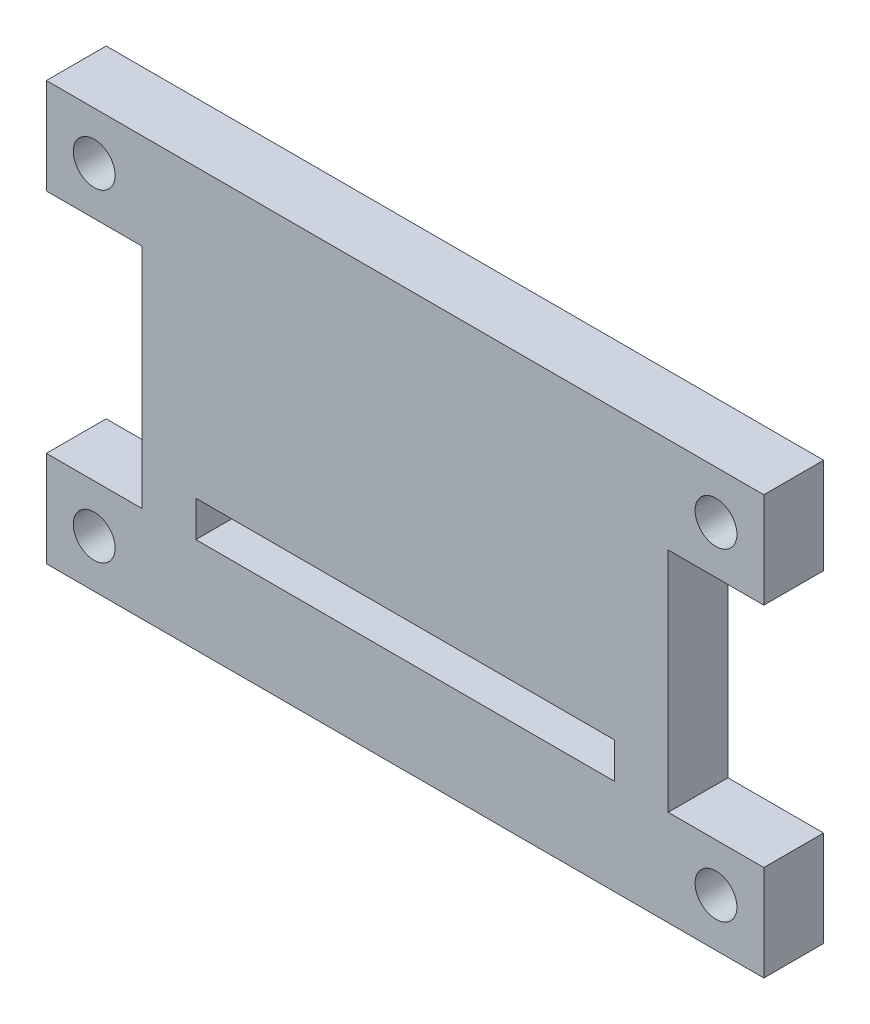
ISO-10303-21;
HEADER;
FILE_DESCRIPTION(('STEP AP214'),'2;1');
FILE_NAME('part.step','',(''),(''),'','','');
FILE_SCHEMA(('AUTOMOTIVE_DESIGN { 1 0 10303 214 1 1 1 1 }'));
ENDSEC;
DATA;
#1=APPLICATION_CONTEXT('core data for automotive mechanical design processes');
#2=APPLICATION_PROTOCOL_DEFINITION('international standard','automotive_design',2000,#1);
#3=PRODUCT_CONTEXT('',#1,'mechanical');
#4=PRODUCT('Part','Part','',(#3));
#5=PRODUCT_RELATED_PRODUCT_CATEGORY('part','',(#4));
#6=PRODUCT_DEFINITION_FORMATION('','',#4);
#7=PRODUCT_DEFINITION_CONTEXT('part definition',#1,'design');
#8=PRODUCT_DEFINITION('design','',#6,#7);
#9=PRODUCT_DEFINITION_SHAPE('','',#8);
#10=(LENGTH_UNIT() NAMED_UNIT(*) SI_UNIT(.MILLI.,.METRE.));
#11=(NAMED_UNIT(*) PLANE_ANGLE_UNIT() SI_UNIT($,.RADIAN.));
#12=(NAMED_UNIT(*) SI_UNIT($,.STERADIAN.) SOLID_ANGLE_UNIT());
#13=UNCERTAINTY_MEASURE_WITH_UNIT(LENGTH_MEASURE(1.E-05),#10,'distance_accuracy_value','');
#14=(GEOMETRIC_REPRESENTATION_CONTEXT(3) GLOBAL_UNCERTAINTY_ASSIGNED_CONTEXT((#13)) GLOBAL_UNIT_ASSIGNED_CONTEXT((#10,
#11,#12)) REPRESENTATION_CONTEXT('',''));
#15=CARTESIAN_POINT('',(0.,0.,0.));
#16=DIRECTION('',(0.,0.,1.));
#17=DIRECTION('',(1.,0.,0.));
#18=AXIS2_PLACEMENT_3D('',#15,#16,#17);
#19=CARTESIAN_POINT('',(0.,17.5,5.));
#20=DIRECTION('',(0.,1.,0.));
#21=DIRECTION('',(0.,0.,1.));
#22=AXIS2_PLACEMENT_3D('',#19,#20,#21);
#23=PLANE('',#22);
#24=DIRECTION('',(1.,0.,0.));
#25=VECTOR('',#24,1.);
#26=CARTESIAN_POINT('',(0.,17.5,0.));
#27=LINE('',#26,#25);
#28=CARTESIAN_POINT('',(-30.,17.5,0.));
#29=VERTEX_POINT('',#28);
#30=CARTESIAN_POINT('',(30.,17.5,0.));
#31=VERTEX_POINT('',#30);
#32=EDGE_CURVE('E232',#29,#31,#27,.T.);
#33=ORIENTED_EDGE('',*,*,#32,.F.);
#34=DIRECTION('',(0.,0.,-1.));
#35=VECTOR('',#34,1.);
#36=CARTESIAN_POINT('',(-30.,17.5,5.));
#37=LINE('',#36,#35);
#38=CARTESIAN_POINT('',(-30.,17.5,5.));
#39=VERTEX_POINT('',#38);
#40=EDGE_CURVE('E11',#39,#29,#37,.T.);
#41=ORIENTED_EDGE('',*,*,#40,.F.);
#42=DIRECTION('',(1.,0.,0.));
#43=VECTOR('',#42,1.);
#44=CARTESIAN_POINT('',(0.,17.5,5.));
#45=LINE('',#44,#43);
#46=CARTESIAN_POINT('',(30.,17.5,5.));
#47=VERTEX_POINT('',#46);
#48=EDGE_CURVE('E187',#39,#47,#45,.T.);
#49=ORIENTED_EDGE('',*,*,#48,.T.);
#50=DIRECTION('',(0.,0.,-1.));
#51=VECTOR('',#50,1.);
#52=CARTESIAN_POINT('',(30.,17.5,5.));
#53=LINE('',#52,#51);
#54=EDGE_CURVE('E229',#47,#31,#53,.T.);
#55=ORIENTED_EDGE('',*,*,#54,.T.);
#56=EDGE_LOOP('',(#33,#41,#49,#55));
#57=FACE_BOUND('',#56,.T.);
#58=ADVANCED_FACE('F35',(#57),#23,.T.);
#59=CARTESIAN_POINT('',(-30.,0.,5.));
#60=DIRECTION('',(-1.,0.,0.));
#61=DIRECTION('',(0.,-1.,0.));
#62=AXIS2_PLACEMENT_3D('',#59,#60,#61);
#63=PLANE('',#62);
#64=DIRECTION('',(0.,1.,0.));
#65=VECTOR('',#64,1.);
#66=CARTESIAN_POINT('',(-30.,0.,0.));
#67=LINE('',#66,#65);
#68=CARTESIAN_POINT('',(-30.,9.5,0.));
#69=VERTEX_POINT('',#68);
#70=EDGE_CURVE('E235',#69,#29,#67,.T.);
#71=ORIENTED_EDGE('',*,*,#70,.F.);
#72=DIRECTION('',(0.,0.,-1.));
#73=VECTOR('',#72,1.);
#74=CARTESIAN_POINT('',(-30.,9.5,5.));
#75=LINE('',#74,#73);
#76=CARTESIAN_POINT('',(-30.,9.5,5.));
#77=VERTEX_POINT('',#76);
#78=EDGE_CURVE('E43',#77,#69,#75,.T.);
#79=ORIENTED_EDGE('',*,*,#78,.F.);
#80=DIRECTION('',(0.,1.,0.));
#81=VECTOR('',#80,1.);
#82=CARTESIAN_POINT('',(-30.,0.,5.));
#83=LINE('',#82,#81);
#84=EDGE_CURVE('E191',#77,#39,#83,.T.);
#85=ORIENTED_EDGE('',*,*,#84,.T.);
#86=ORIENTED_EDGE('',*,*,#40,.T.);
#87=EDGE_LOOP('',(#71,#79,#85,#86));
#88=FACE_BOUND('',#87,.T.);
#89=ADVANCED_FACE('F306',(#88),#63,.T.);
#90=CARTESIAN_POINT('',(0.,9.5,5.));
#91=DIRECTION('',(0.,1.,0.));
#92=DIRECTION('',(0.,0.,1.));
#93=AXIS2_PLACEMENT_3D('',#90,#91,#92);
#94=PLANE('',#93);
#95=DIRECTION('',(1.,0.,0.));
#96=VECTOR('',#95,1.);
#97=CARTESIAN_POINT('',(0.,9.5,0.));
#98=LINE('',#97,#96);
#99=CARTESIAN_POINT('',(-22.,9.5,0.));
#100=VERTEX_POINT('',#99);
#101=EDGE_CURVE('E238',#69,#100,#98,.T.);
#102=ORIENTED_EDGE('',*,*,#101,.T.);
#103=DIRECTION('',(0.,0.,-1.));
#104=VECTOR('',#103,1.);
#105=CARTESIAN_POINT('',(-22.,9.5,5.));
#106=LINE('',#105,#104);
#107=CARTESIAN_POINT('',(-22.,9.5,5.));
#108=VERTEX_POINT('',#107);
#109=EDGE_CURVE('E294',#108,#100,#106,.T.);
#110=ORIENTED_EDGE('',*,*,#109,.F.);
#111=DIRECTION('',(1.,0.,0.));
#112=VECTOR('',#111,1.);
#113=CARTESIAN_POINT('',(0.,9.5,5.));
#114=LINE('',#113,#112);
#115=EDGE_CURVE('E194',#77,#108,#114,.T.);
#116=ORIENTED_EDGE('',*,*,#115,.F.);
#117=ORIENTED_EDGE('',*,*,#78,.T.);
#118=EDGE_LOOP('',(#102,#110,#116,#117));
#119=FACE_BOUND('',#118,.T.);
#120=ADVANCED_FACE('F299',(#119),#94,.F.);
#121=CARTESIAN_POINT('',(-22.,0.,5.));
#122=DIRECTION('',(1.,0.,0.));
#123=DIRECTION('',(0.,0.,-1.));
#124=AXIS2_PLACEMENT_3D('',#121,#122,#123);
#125=PLANE('',#124);
#126=DIRECTION('',(0.,-1.,0.));
#127=VECTOR('',#126,1.);
#128=CARTESIAN_POINT('',(-22.,0.,0.));
#129=LINE('',#128,#127);
#130=CARTESIAN_POINT('',(-22.,-9.49999999999999,0.));
#131=VERTEX_POINT('',#130);
#132=EDGE_CURVE('E241',#100,#131,#129,.T.);
#133=ORIENTED_EDGE('',*,*,#132,.T.);
#134=DIRECTION('',(0.,0.,-1.));
#135=VECTOR('',#134,1.);
#136=CARTESIAN_POINT('',(-22.,-9.49999999999999,5.));
#137=LINE('',#136,#135);
#138=CARTESIAN_POINT('',(-22.,-9.49999999999999,5.));
#139=VERTEX_POINT('',#138);
#140=EDGE_CURVE('E292',#139,#131,#137,.T.);
#141=ORIENTED_EDGE('',*,*,#140,.F.);
#142=DIRECTION('',(0.,-1.,0.));
#143=VECTOR('',#142,1.);
#144=CARTESIAN_POINT('',(-22.,0.,5.));
#145=LINE('',#144,#143);
#146=EDGE_CURVE('E197',#108,#139,#145,.T.);
#147=ORIENTED_EDGE('',*,*,#146,.F.);
#148=ORIENTED_EDGE('',*,*,#109,.T.);
#149=EDGE_LOOP('',(#133,#141,#147,#148));
#150=FACE_BOUND('',#149,.T.);
#151=ADVANCED_FACE('F343',(#150),#125,.F.);
#152=CARTESIAN_POINT('',(0.,-9.49999999999999,5.));
#153=DIRECTION('',(0.,1.,0.));
#154=DIRECTION('',(0.,0.,1.));
#155=AXIS2_PLACEMENT_3D('',#152,#153,#154);
#156=PLANE('',#155);
#157=DIRECTION('',(1.,0.,0.));
#158=VECTOR('',#157,1.);
#159=CARTESIAN_POINT('',(0.,-9.49999999999999,0.));
#160=LINE('',#159,#158);
#161=CARTESIAN_POINT('',(-30.,-9.49999999999999,0.));
#162=VERTEX_POINT('',#161);
#163=EDGE_CURVE('E244',#162,#131,#160,.T.);
#164=ORIENTED_EDGE('',*,*,#163,.F.);
#165=DIRECTION('',(0.,0.,-1.));
#166=VECTOR('',#165,1.);
#167=CARTESIAN_POINT('',(-30.,-9.49999999999999,5.));
#168=LINE('',#167,#166);
#169=CARTESIAN_POINT('',(-30.,-9.49999999999999,5.));
#170=VERTEX_POINT('',#169);
#171=EDGE_CURVE('E290',#170,#162,#168,.T.);
#172=ORIENTED_EDGE('',*,*,#171,.F.);
#173=DIRECTION('',(1.,0.,0.));
#174=VECTOR('',#173,1.);
#175=CARTESIAN_POINT('',(0.,-9.49999999999999,5.));
#176=LINE('',#175,#174);
#177=EDGE_CURVE('E199',#170,#139,#176,.T.);
#178=ORIENTED_EDGE('',*,*,#177,.T.);
#179=ORIENTED_EDGE('',*,*,#140,.T.);
#180=EDGE_LOOP('',(#164,#172,#178,#179));
#181=FACE_BOUND('',#180,.T.);
#182=ADVANCED_FACE('F338',(#181),#156,.T.);
#183=CARTESIAN_POINT('',(-30.,0.,5.));
#184=DIRECTION('',(1.,0.,0.));
#185=DIRECTION('',(0.,1.,0.));
#186=AXIS2_PLACEMENT_3D('',#183,#184,#185);
#187=PLANE('',#186);
#188=DIRECTION('',(0.,-1.,0.));
#189=VECTOR('',#188,1.);
#190=CARTESIAN_POINT('',(-30.,0.,0.));
#191=LINE('',#190,#189);
#192=CARTESIAN_POINT('',(-30.,-17.5,0.));
#193=VERTEX_POINT('',#192);
#194=EDGE_CURVE('E247',#162,#193,#191,.T.);
#195=ORIENTED_EDGE('',*,*,#194,.T.);
#196=DIRECTION('',(0.,0.,-1.));
#197=VECTOR('',#196,1.);
#198=CARTESIAN_POINT('',(-30.,-17.5,5.));
#199=LINE('',#198,#197);
#200=CARTESIAN_POINT('',(-30.,-17.5,5.));
#201=VERTEX_POINT('',#200);
#202=EDGE_CURVE('E287',#201,#193,#199,.T.);
#203=ORIENTED_EDGE('',*,*,#202,.F.);
#204=DIRECTION('',(0.,-1.,0.));
#205=VECTOR('',#204,1.);
#206=CARTESIAN_POINT('',(-30.,0.,5.));
#207=LINE('',#206,#205);
#208=EDGE_CURVE('E202',#170,#201,#207,.T.);
#209=ORIENTED_EDGE('',*,*,#208,.F.);
#210=ORIENTED_EDGE('',*,*,#171,.T.);
#211=EDGE_LOOP('',(#195,#203,#209,#210));
#212=FACE_BOUND('',#211,.T.);
#213=ADVANCED_FACE('F373',(#212),#187,.F.);
#214=CARTESIAN_POINT('',(0.,-17.5,5.));
#215=DIRECTION('',(0.,1.,0.));
#216=DIRECTION('',(-1.,0.,0.));
#217=AXIS2_PLACEMENT_3D('',#214,#215,#216);
#218=PLANE('',#217);
#219=DIRECTION('',(1.,0.,0.));
#220=VECTOR('',#219,1.);
#221=CARTESIAN_POINT('',(0.,-17.5,0.));
#222=LINE('',#221,#220);
#223=CARTESIAN_POINT('',(30.,-17.5,0.));
#224=VERTEX_POINT('',#223);
#225=EDGE_CURVE('E250',#193,#224,#222,.T.);
#226=ORIENTED_EDGE('',*,*,#225,.T.);
#227=DIRECTION('',(0.,0.,-1.));
#228=VECTOR('',#227,1.);
#229=CARTESIAN_POINT('',(30.,-17.5,5.));
#230=LINE('',#229,#228);
#231=CARTESIAN_POINT('',(30.,-17.5,5.));
#232=VERTEX_POINT('',#231);
#233=EDGE_CURVE('E285',#232,#224,#230,.T.);
#234=ORIENTED_EDGE('',*,*,#233,.F.);
#235=DIRECTION('',(1.,0.,0.));
#236=VECTOR('',#235,1.);
#237=CARTESIAN_POINT('',(0.,-17.5,5.));
#238=LINE('',#237,#236);
#239=EDGE_CURVE('E205',#201,#232,#238,.T.);
#240=ORIENTED_EDGE('',*,*,#239,.F.);
#241=ORIENTED_EDGE('',*,*,#202,.T.);
#242=EDGE_LOOP('',(#226,#234,#240,#241));
#243=FACE_BOUND('',#242,.T.);
#244=ADVANCED_FACE('F332',(#243),#218,.F.);
#245=CARTESIAN_POINT('',(30.,0.,5.));
#246=DIRECTION('',(1.,0.,0.));
#247=DIRECTION('',(0.,0.,-1.));
#248=AXIS2_PLACEMENT_3D('',#245,#246,#247);
#249=PLANE('',#248);
#250=DIRECTION('',(0.,-1.,0.));
#251=VECTOR('',#250,1.);
#252=CARTESIAN_POINT('',(30.,0.,0.));
#253=LINE('',#252,#251);
#254=CARTESIAN_POINT('',(30.,-9.49999999999999,0.));
#255=VERTEX_POINT('',#254);
#256=EDGE_CURVE('E253',#255,#224,#253,.T.);
#257=ORIENTED_EDGE('',*,*,#256,.F.);
#258=DIRECTION('',(0.,0.,-1.));
#259=VECTOR('',#258,1.);
#260=CARTESIAN_POINT('',(30.,-9.49999999999999,5.));
#261=LINE('',#260,#259);
#262=CARTESIAN_POINT('',(30.,-9.49999999999999,5.));
#263=VERTEX_POINT('',#262);
#264=EDGE_CURVE('E283',#263,#255,#261,.T.);
#265=ORIENTED_EDGE('',*,*,#264,.F.);
#266=DIRECTION('',(0.,-1.,0.));
#267=VECTOR('',#266,1.);
#268=CARTESIAN_POINT('',(30.,0.,5.));
#269=LINE('',#268,#267);
#270=EDGE_CURVE('E207',#263,#232,#269,.T.);
#271=ORIENTED_EDGE('',*,*,#270,.T.);
#272=ORIENTED_EDGE('',*,*,#233,.T.);
#273=EDGE_LOOP('',(#257,#265,#271,#272));
#274=FACE_BOUND('',#273,.T.);
#275=ADVANCED_FACE('F327',(#274),#249,.T.);
#276=CARTESIAN_POINT('',(0.,-9.49999999999999,5.));
#277=DIRECTION('',(0.,-1.,0.));
#278=DIRECTION('',(0.,0.,-1.));
#279=AXIS2_PLACEMENT_3D('',#276,#277,#278);
#280=PLANE('',#279);
#281=DIRECTION('',(-1.,0.,0.));
#282=VECTOR('',#281,1.);
#283=CARTESIAN_POINT('',(0.,-9.49999999999999,0.));
#284=LINE('',#283,#282);
#285=CARTESIAN_POINT('',(22.,-9.49999999999999,0.));
#286=VERTEX_POINT('',#285);
#287=EDGE_CURVE('E256',#255,#286,#284,.T.);
#288=ORIENTED_EDGE('',*,*,#287,.T.);
#289=DIRECTION('',(0.,0.,-1.));
#290=VECTOR('',#289,1.);
#291=CARTESIAN_POINT('',(22.,-9.49999999999999,5.));
#292=LINE('',#291,#290);
#293=CARTESIAN_POINT('',(22.,-9.49999999999999,5.));
#294=VERTEX_POINT('',#293);
#295=EDGE_CURVE('E281',#294,#286,#292,.T.);
#296=ORIENTED_EDGE('',*,*,#295,.F.);
#297=DIRECTION('',(-1.,0.,0.));
#298=VECTOR('',#297,1.);
#299=CARTESIAN_POINT('',(0.,-9.49999999999999,5.));
#300=LINE('',#299,#298);
#301=EDGE_CURVE('E210',#263,#294,#300,.T.);
#302=ORIENTED_EDGE('',*,*,#301,.F.);
#303=ORIENTED_EDGE('',*,*,#264,.T.);
#304=EDGE_LOOP('',(#288,#296,#302,#303));
#305=FACE_BOUND('',#304,.T.);
#306=ADVANCED_FACE('F380',(#305),#280,.F.);
#307=CARTESIAN_POINT('',(22.,0.,5.));
#308=DIRECTION('',(1.,0.,0.));
#309=DIRECTION('',(0.,0.,-1.));
#310=AXIS2_PLACEMENT_3D('',#307,#308,#309);
#311=PLANE('',#310);
#312=DIRECTION('',(0.,-1.,0.));
#313=VECTOR('',#312,1.);
#314=CARTESIAN_POINT('',(22.,0.,0.));
#315=LINE('',#314,#313);
#316=CARTESIAN_POINT('',(22.,9.5,0.));
#317=VERTEX_POINT('',#316);
#318=EDGE_CURVE('E259',#317,#286,#315,.T.);
#319=ORIENTED_EDGE('',*,*,#318,.F.);
#320=DIRECTION('',(0.,0.,-1.));
#321=VECTOR('',#320,1.);
#322=CARTESIAN_POINT('',(22.,9.5,5.));
#323=LINE('',#322,#321);
#324=CARTESIAN_POINT('',(22.,9.5,5.));
#325=VERTEX_POINT('',#324);
#326=EDGE_CURVE('E279',#325,#317,#323,.T.);
#327=ORIENTED_EDGE('',*,*,#326,.F.);
#328=DIRECTION('',(0.,-1.,0.));
#329=VECTOR('',#328,1.);
#330=CARTESIAN_POINT('',(22.,0.,5.));
#331=LINE('',#330,#329);
#332=EDGE_CURVE('E212',#325,#294,#331,.T.);
#333=ORIENTED_EDGE('',*,*,#332,.T.);
#334=ORIENTED_EDGE('',*,*,#295,.T.);
#335=EDGE_LOOP('',(#319,#327,#333,#334));
#336=FACE_BOUND('',#335,.T.);
#337=ADVANCED_FACE('F321',(#336),#311,.T.);
#338=CARTESIAN_POINT('',(0.,9.49999999999999,5.));
#339=DIRECTION('',(0.,-1.,0.));
#340=DIRECTION('',(1.,0.,0.));
#341=AXIS2_PLACEMENT_3D('',#338,#339,#340);
#342=PLANE('',#341);
#343=DIRECTION('',(-1.,0.,0.));
#344=VECTOR('',#343,1.);
#345=CARTESIAN_POINT('',(0.,9.49999999999999,0.));
#346=LINE('',#345,#344);
#347=CARTESIAN_POINT('',(30.,9.50000000000001,0.));
#348=VERTEX_POINT('',#347);
#349=EDGE_CURVE('E262',#348,#317,#346,.T.);
#350=ORIENTED_EDGE('',*,*,#349,.F.);
#351=DIRECTION('',(0.,0.,-1.));
#352=VECTOR('',#351,1.);
#353=CARTESIAN_POINT('',(30.,9.50000000000001,5.));
#354=LINE('',#353,#352);
#355=CARTESIAN_POINT('',(30.,9.50000000000001,5.));
#356=VERTEX_POINT('',#355);
#357=EDGE_CURVE('E277',#356,#348,#354,.T.);
#358=ORIENTED_EDGE('',*,*,#357,.F.);
#359=DIRECTION('',(-1.,0.,0.));
#360=VECTOR('',#359,1.);
#361=CARTESIAN_POINT('',(0.,9.49999999999999,5.));
#362=LINE('',#361,#360);
#363=EDGE_CURVE('E215',#356,#325,#362,.T.);
#364=ORIENTED_EDGE('',*,*,#363,.T.);
#365=ORIENTED_EDGE('',*,*,#326,.T.);
#366=EDGE_LOOP('',(#350,#358,#364,#365));
#367=FACE_BOUND('',#366,.T.);
#368=ADVANCED_FACE('F315',(#367),#342,.T.);
#369=CARTESIAN_POINT('',(26.,-13.5,5.));
#370=DIRECTION('',(0.,0.,-1.));
#371=DIRECTION('',(-1.,0.,0.));
#372=AXIS2_PLACEMENT_3D('',#369,#370,#371);
#373=CYLINDRICAL_SURFACE('',#372,1.75);
#374=CARTESIAN_POINT('',(26.,-13.5,5.));
#375=DIRECTION('',(0.,0.,1.));
#376=DIRECTION('',(1.,0.,0.));
#377=AXIS2_PLACEMENT_3D('',#374,#375,#376);
#378=CIRCLE('',#377,1.75);
#379=CARTESIAN_POINT('',(27.75,-13.5,5.));
#380=VERTEX_POINT('',#379);
#381=EDGE_CURVE('E223',#380,#380,#378,.T.);
#382=ORIENTED_EDGE('',*,*,#381,.T.);
#383=EDGE_LOOP('',(#382));
#384=FACE_BOUND('',#383,.T.);
#385=CARTESIAN_POINT('',(26.,-13.5,0.));
#386=DIRECTION('',(0.,0.,1.));
#387=DIRECTION('',(1.,0.,0.));
#388=AXIS2_PLACEMENT_3D('',#385,#386,#387);
#389=CIRCLE('',#388,1.75);
#390=CARTESIAN_POINT('',(27.75,-13.5,0.));
#391=VERTEX_POINT('',#390);
#392=EDGE_CURVE('E271',#391,#391,#389,.T.);
#393=ORIENTED_EDGE('',*,*,#392,.F.);
#394=EDGE_LOOP('',(#393));
#395=FACE_BOUND('',#394,.T.);
#396=ADVANCED_FACE('F357',(#384,#395),#373,.F.);
#397=CARTESIAN_POINT('',(-26.,-13.5,5.));
#398=DIRECTION('',(0.,0.,-1.));
#399=DIRECTION('',(-1.,0.,0.));
#400=AXIS2_PLACEMENT_3D('',#397,#398,#399);
#401=CYLINDRICAL_SURFACE('',#400,1.75);
#402=CARTESIAN_POINT('',(-26.,-13.5,5.));
#403=DIRECTION('',(0.,0.,1.));
#404=DIRECTION('',(1.,0.,0.));
#405=AXIS2_PLACEMENT_3D('',#402,#403,#404);
#406=CIRCLE('',#405,1.75);
#407=CARTESIAN_POINT('',(-24.25,-13.5,5.));
#408=VERTEX_POINT('',#407);
#409=EDGE_CURVE('E220',#408,#408,#406,.T.);
#410=ORIENTED_EDGE('',*,*,#409,.T.);
#411=EDGE_LOOP('',(#410));
#412=FACE_BOUND('',#411,.T.);
#413=CARTESIAN_POINT('',(-26.,-13.5,0.));
#414=DIRECTION('',(0.,0.,1.));
#415=DIRECTION('',(1.,0.,0.));
#416=AXIS2_PLACEMENT_3D('',#413,#414,#415);
#417=CIRCLE('',#416,1.75);
#418=CARTESIAN_POINT('',(-24.25,-13.5,0.));
#419=VERTEX_POINT('',#418);
#420=EDGE_CURVE('E268',#419,#419,#417,.T.);
#421=ORIENTED_EDGE('',*,*,#420,.F.);
#422=EDGE_LOOP('',(#421));
#423=FACE_BOUND('',#422,.T.);
#424=ADVANCED_FACE('F349',(#412,#423),#401,.F.);
#425=CARTESIAN_POINT('',(30.,0.,5.));
#426=DIRECTION('',(-1.,0.,0.));
#427=DIRECTION('',(0.,0.,1.));
#428=AXIS2_PLACEMENT_3D('',#425,#426,#427);
#429=PLANE('',#428);
#430=DIRECTION('',(0.,1.,0.));
#431=VECTOR('',#430,1.);
#432=CARTESIAN_POINT('',(30.,0.,0.));
#433=LINE('',#432,#431);
#434=EDGE_CURVE('E265',#348,#31,#433,.T.);
#435=ORIENTED_EDGE('',*,*,#434,.T.);
#436=ORIENTED_EDGE('',*,*,#54,.F.);
#437=DIRECTION('',(0.,1.,0.));
#438=VECTOR('',#437,1.);
#439=CARTESIAN_POINT('',(30.,0.,5.));
#440=LINE('',#439,#438);
#441=EDGE_CURVE('E218',#356,#47,#440,.T.);
#442=ORIENTED_EDGE('',*,*,#441,.F.);
#443=ORIENTED_EDGE('',*,*,#357,.T.);
#444=EDGE_LOOP('',(#435,#436,#442,#443));
#445=FACE_BOUND('',#444,.T.);
#446=ADVANCED_FACE('F347',(#445),#429,.F.);
#447=CARTESIAN_POINT('',(-26.,13.5,5.));
#448=DIRECTION('',(0.,0.,-1.));
#449=DIRECTION('',(-1.,0.,0.));
#450=AXIS2_PLACEMENT_3D('',#447,#448,#449);
#451=CYLINDRICAL_SURFACE('',#450,1.75);
#452=CARTESIAN_POINT('',(-26.,13.5,5.));
#453=DIRECTION('',(0.,0.,1.));
#454=DIRECTION('',(1.,0.,0.));
#455=AXIS2_PLACEMENT_3D('',#452,#453,#454);
#456=CIRCLE('',#455,1.75);
#457=CARTESIAN_POINT('',(-24.25,13.5,5.));
#458=VERTEX_POINT('',#457);
#459=EDGE_CURVE('E184',#458,#458,#456,.T.);
#460=ORIENTED_EDGE('',*,*,#459,.T.);
#461=EDGE_LOOP('',(#460));
#462=FACE_BOUND('',#461,.T.);
#463=CARTESIAN_POINT('',(-26.,13.5,0.));
#464=DIRECTION('',(0.,0.,1.));
#465=DIRECTION('',(1.,0.,0.));
#466=AXIS2_PLACEMENT_3D('',#463,#464,#465);
#467=CIRCLE('',#466,1.75);
#468=CARTESIAN_POINT('',(-24.25,13.5,0.));
#469=VERTEX_POINT('',#468);
#470=EDGE_CURVE('E161',#469,#469,#467,.T.);
#471=ORIENTED_EDGE('',*,*,#470,.F.);
#472=EDGE_LOOP('',(#471));
#473=FACE_BOUND('',#472,.T.);
#474=ADVANCED_FACE('F37',(#462,#473),#451,.F.);
#475=CARTESIAN_POINT('',(26.,13.5,5.));
#476=DIRECTION('',(0.,0.,-1.));
#477=DIRECTION('',(-1.,0.,0.));
#478=AXIS2_PLACEMENT_3D('',#475,#476,#477);
#479=CYLINDRICAL_SURFACE('',#478,1.75);
#480=CARTESIAN_POINT('',(26.,13.5,5.));
#481=DIRECTION('',(0.,0.,1.));
#482=DIRECTION('',(1.,0.,0.));
#483=AXIS2_PLACEMENT_3D('',#480,#481,#482);
#484=CIRCLE('',#483,1.75);
#485=CARTESIAN_POINT('',(27.75,13.5,5.));
#486=VERTEX_POINT('',#485);
#487=EDGE_CURVE('E226',#486,#486,#484,.T.);
#488=ORIENTED_EDGE('',*,*,#487,.T.);
#489=EDGE_LOOP('',(#488));
#490=FACE_BOUND('',#489,.T.);
#491=CARTESIAN_POINT('',(26.,13.5,0.));
#492=DIRECTION('',(0.,0.,1.));
#493=DIRECTION('',(1.,0.,0.));
#494=AXIS2_PLACEMENT_3D('',#491,#492,#493);
#495=CIRCLE('',#494,1.75);
#496=CARTESIAN_POINT('',(27.75,13.5,0.));
#497=VERTEX_POINT('',#496);
#498=EDGE_CURVE('E188',#497,#497,#495,.T.);
#499=ORIENTED_EDGE('',*,*,#498,.F.);
#500=EDGE_LOOP('',(#499));
#501=FACE_BOUND('',#500,.T.);
#502=ADVANCED_FACE('F355',(#490,#501),#479,.F.);
#503=CARTESIAN_POINT('',(0.,0.,5.));
#504=DIRECTION('',(0.,0.,1.));
#505=DIRECTION('',(1.,0.,0.));
#506=AXIS2_PLACEMENT_3D('',#503,#504,#505);
#507=PLANE('',#506);
#508=DIRECTION('',(0.,1.,0.));
#509=VECTOR('',#508,1.);
#510=CARTESIAN_POINT('',(17.5,-6.49999999999999,5.));
#511=LINE('',#510,#509);
#512=CARTESIAN_POINT('',(17.5,-9.49999999999999,5.));
#513=VERTEX_POINT('',#512);
#514=CARTESIAN_POINT('',(17.5,-6.49999999999999,5.));
#515=VERTEX_POINT('',#514);
#516=EDGE_CURVE('E50',#513,#515,#511,.T.);
#517=ORIENTED_EDGE('',*,*,#516,.F.);
#518=DIRECTION('',(1.,0.,0.));
#519=VECTOR('',#518,1.);
#520=CARTESIAN_POINT('',(-17.5,-9.49999999999999,5.));
#521=LINE('',#520,#519);
#522=CARTESIAN_POINT('',(-17.5,-9.49999999999999,5.));
#523=VERTEX_POINT('',#522);
#524=EDGE_CURVE('E155',#523,#513,#521,.T.);
#525=ORIENTED_EDGE('',*,*,#524,.F.);
#526=DIRECTION('',(0.,-1.,0.));
#527=VECTOR('',#526,1.);
#528=CARTESIAN_POINT('',(-17.5,-6.49999999999999,5.));
#529=LINE('',#528,#527);
#530=CARTESIAN_POINT('',(-17.5,-6.49999999999999,5.));
#531=VERTEX_POINT('',#530);
#532=EDGE_CURVE('E175',#531,#523,#529,.T.);
#533=ORIENTED_EDGE('',*,*,#532,.F.);
#534=DIRECTION('',(-1.,0.,0.));
#535=VECTOR('',#534,1.);
#536=CARTESIAN_POINT('',(-17.5,-6.49999999999999,5.));
#537=LINE('',#536,#535);
#538=EDGE_CURVE('E169',#515,#531,#537,.T.);
#539=ORIENTED_EDGE('',*,*,#538,.F.);
#540=EDGE_LOOP('',(#517,#525,#533,#539));
#541=FACE_BOUND('',#540,.T.);
#542=ORIENTED_EDGE('',*,*,#459,.F.);
#543=EDGE_LOOP('',(#542));
#544=FACE_BOUND('',#543,.T.);
#545=ORIENTED_EDGE('',*,*,#48,.F.);
#546=ORIENTED_EDGE('',*,*,#84,.F.);
#547=ORIENTED_EDGE('',*,*,#115,.T.);
#548=ORIENTED_EDGE('',*,*,#146,.T.);
#549=ORIENTED_EDGE('',*,*,#177,.F.);
#550=ORIENTED_EDGE('',*,*,#208,.T.);
#551=ORIENTED_EDGE('',*,*,#239,.T.);
#552=ORIENTED_EDGE('',*,*,#270,.F.);
#553=ORIENTED_EDGE('',*,*,#301,.T.);
#554=ORIENTED_EDGE('',*,*,#332,.F.);
#555=ORIENTED_EDGE('',*,*,#363,.F.);
#556=ORIENTED_EDGE('',*,*,#441,.T.);
#557=EDGE_LOOP('',(#545,#546,#547,#548,#549,#550,#551,#552,#553,#554,#555,#556));
#558=FACE_BOUND('',#557,.T.);
#559=ORIENTED_EDGE('',*,*,#409,.F.);
#560=EDGE_LOOP('',(#559));
#561=FACE_BOUND('',#560,.T.);
#562=ORIENTED_EDGE('',*,*,#381,.F.);
#563=EDGE_LOOP('',(#562));
#564=FACE_BOUND('',#563,.T.);
#565=ORIENTED_EDGE('',*,*,#487,.F.);
#566=EDGE_LOOP('',(#565));
#567=FACE_BOUND('',#566,.T.);
#568=ADVANCED_FACE('F345',(#541,#544,#558,#561,#564,#567),#507,.T.);
#569=CARTESIAN_POINT('',(0.,0.,0.));
#570=DIRECTION('',(0.,0.,1.));
#571=DIRECTION('',(1.,0.,0.));
#572=AXIS2_PLACEMENT_3D('',#569,#570,#571);
#573=PLANE('',#572);
#574=DIRECTION('',(-1.,0.,0.));
#575=VECTOR('',#574,1.);
#576=CARTESIAN_POINT('',(-17.5,-9.49999999999999,0.));
#577=LINE('',#576,#575);
#578=CARTESIAN_POINT('',(17.5,-9.49999999999999,0.));
#579=VERTEX_POINT('',#578);
#580=CARTESIAN_POINT('',(-17.5,-9.49999999999999,0.));
#581=VERTEX_POINT('',#580);
#582=EDGE_CURVE('E167',#579,#581,#577,.T.);
#583=ORIENTED_EDGE('',*,*,#582,.F.);
#584=DIRECTION('',(0.,-1.,0.));
#585=VECTOR('',#584,1.);
#586=CARTESIAN_POINT('',(17.5,-6.49999999999999,0.));
#587=LINE('',#586,#585);
#588=CARTESIAN_POINT('',(17.5,-6.49999999999999,0.));
#589=VERTEX_POINT('',#588);
#590=EDGE_CURVE('E149',#589,#579,#587,.T.);
#591=ORIENTED_EDGE('',*,*,#590,.F.);
#592=DIRECTION('',(1.,0.,0.));
#593=VECTOR('',#592,1.);
#594=CARTESIAN_POINT('',(-17.5,-6.49999999999999,0.));
#595=LINE('',#594,#593);
#596=CARTESIAN_POINT('',(-17.5,-6.49999999999999,0.));
#597=VERTEX_POINT('',#596);
#598=EDGE_CURVE('E158',#597,#589,#595,.T.);
#599=ORIENTED_EDGE('',*,*,#598,.F.);
#600=DIRECTION('',(0.,1.,0.));
#601=VECTOR('',#600,1.);
#602=CARTESIAN_POINT('',(-17.5,-6.49999999999999,0.));
#603=LINE('',#602,#601);
#604=EDGE_CURVE('E58',#581,#597,#603,.T.);
#605=ORIENTED_EDGE('',*,*,#604,.F.);
#606=EDGE_LOOP('',(#583,#591,#599,#605));
#607=FACE_BOUND('',#606,.T.);
#608=ORIENTED_EDGE('',*,*,#470,.T.);
#609=EDGE_LOOP('',(#608));
#610=FACE_BOUND('',#609,.T.);
#611=ORIENTED_EDGE('',*,*,#32,.T.);
#612=ORIENTED_EDGE('',*,*,#434,.F.);
#613=ORIENTED_EDGE('',*,*,#349,.T.);
#614=ORIENTED_EDGE('',*,*,#318,.T.);
#615=ORIENTED_EDGE('',*,*,#287,.F.);
#616=ORIENTED_EDGE('',*,*,#256,.T.);
#617=ORIENTED_EDGE('',*,*,#225,.F.);
#618=ORIENTED_EDGE('',*,*,#194,.F.);
#619=ORIENTED_EDGE('',*,*,#163,.T.);
#620=ORIENTED_EDGE('',*,*,#132,.F.);
#621=ORIENTED_EDGE('',*,*,#101,.F.);
#622=ORIENTED_EDGE('',*,*,#70,.T.);
#623=EDGE_LOOP('',(#611,#612,#613,#614,#615,#616,#617,#618,#619,#620,#621,#622));
#624=FACE_BOUND('',#623,.T.);
#625=ORIENTED_EDGE('',*,*,#420,.T.);
#626=EDGE_LOOP('',(#625));
#627=FACE_BOUND('',#626,.T.);
#628=ORIENTED_EDGE('',*,*,#392,.T.);
#629=EDGE_LOOP('',(#628));
#630=FACE_BOUND('',#629,.T.);
#631=ORIENTED_EDGE('',*,*,#498,.T.);
#632=EDGE_LOOP('',(#631));
#633=FACE_BOUND('',#632,.T.);
#634=ADVANCED_FACE('F164',(#607,#610,#624,#627,#630,#633),#573,.F.);
#635=CARTESIAN_POINT('',(17.5,-6.49999999999999,-0.00100000000000013));
#636=DIRECTION('',(1.,0.,0.));
#637=DIRECTION('',(0.,0.,-1.));
#638=AXIS2_PLACEMENT_3D('',#635,#636,#637);
#639=PLANE('',#638);
#640=ORIENTED_EDGE('',*,*,#590,.T.);
#641=DIRECTION('',(0.,0.,1.));
#642=VECTOR('',#641,1.);
#643=CARTESIAN_POINT('',(17.5,-9.49999999999999,-0.00100000000000013));
#644=LINE('',#643,#642);
#645=EDGE_CURVE('E162',#579,#513,#644,.T.);
#646=ORIENTED_EDGE('',*,*,#645,.T.);
#647=ORIENTED_EDGE('',*,*,#516,.T.);
#648=DIRECTION('',(0.,0.,1.));
#649=VECTOR('',#648,1.);
#650=CARTESIAN_POINT('',(17.5,-6.49999999999999,-0.00100000000000013));
#651=LINE('',#650,#649);
#652=EDGE_CURVE('E145',#589,#515,#651,.T.);
#653=ORIENTED_EDGE('',*,*,#652,.F.);
#654=EDGE_LOOP('',(#640,#646,#647,#653));
#655=FACE_BOUND('',#654,.T.);
#656=ADVANCED_FACE('F147',(#655),#639,.F.);
#657=CARTESIAN_POINT('',(-17.5,-9.49999999999999,-0.00100000000000013));
#658=DIRECTION('',(0.,-1.,0.));
#659=DIRECTION('',(0.,0.,-1.));
#660=AXIS2_PLACEMENT_3D('',#657,#658,#659);
#661=PLANE('',#660);
#662=ORIENTED_EDGE('',*,*,#582,.T.);
#663=DIRECTION('',(0.,0.,1.));
#664=VECTOR('',#663,1.);
#665=CARTESIAN_POINT('',(-17.5,-9.49999999999999,-0.00100000000000013));
#666=LINE('',#665,#664);
#667=EDGE_CURVE('E181',#581,#523,#666,.T.);
#668=ORIENTED_EDGE('',*,*,#667,.T.);
#669=ORIENTED_EDGE('',*,*,#524,.T.);
#670=ORIENTED_EDGE('',*,*,#645,.F.);
#671=EDGE_LOOP('',(#662,#668,#669,#670));
#672=FACE_BOUND('',#671,.T.);
#673=ADVANCED_FACE('F404',(#672),#661,.F.);
#674=CARTESIAN_POINT('',(-17.5,-6.49999999999999,-0.00100000000000013));
#675=DIRECTION('',(-1.,0.,0.));
#676=DIRECTION('',(0.,0.,1.));
#677=AXIS2_PLACEMENT_3D('',#674,#675,#676);
#678=PLANE('',#677);
#679=ORIENTED_EDGE('',*,*,#604,.T.);
#680=DIRECTION('',(0.,0.,1.));
#681=VECTOR('',#680,1.);
#682=CARTESIAN_POINT('',(-17.5,-6.49999999999999,-0.00100000000000013));
#683=LINE('',#682,#681);
#684=EDGE_CURVE('E154',#597,#531,#683,.T.);
#685=ORIENTED_EDGE('',*,*,#684,.T.);
#686=ORIENTED_EDGE('',*,*,#532,.T.);
#687=ORIENTED_EDGE('',*,*,#667,.F.);
#688=EDGE_LOOP('',(#679,#685,#686,#687));
#689=FACE_BOUND('',#688,.T.);
#690=ADVANCED_FACE('F407',(#689),#678,.F.);
#691=CARTESIAN_POINT('',(-17.5,-6.49999999999999,-0.00100000000000013));
#692=DIRECTION('',(0.,1.,0.));
#693=DIRECTION('',(0.,0.,1.));
#694=AXIS2_PLACEMENT_3D('',#691,#692,#693);
#695=PLANE('',#694);
#696=ORIENTED_EDGE('',*,*,#598,.T.);
#697=ORIENTED_EDGE('',*,*,#652,.T.);
#698=ORIENTED_EDGE('',*,*,#538,.T.);
#699=ORIENTED_EDGE('',*,*,#684,.F.);
#700=EDGE_LOOP('',(#696,#697,#698,#699));
#701=FACE_BOUND('',#700,.T.);
#702=ADVANCED_FACE('F159',(#701),#695,.F.);
#703=CLOSED_SHELL('',(#58,#89,#120,#151,#182,#213,#244,#275,#306,#337,#368,#396,#424,#446,#474,
#502,#568,#634,#656,#673,#690,#702));
#704=MANIFOLD_SOLID_BREP('B2',#703);
#705=ADVANCED_BREP_SHAPE_REPRESENTATION('',(#18,#704),#14);
#706=SHAPE_DEFINITION_REPRESENTATION(#9,#705);
ENDSEC;
END-ISO-10303-21;
